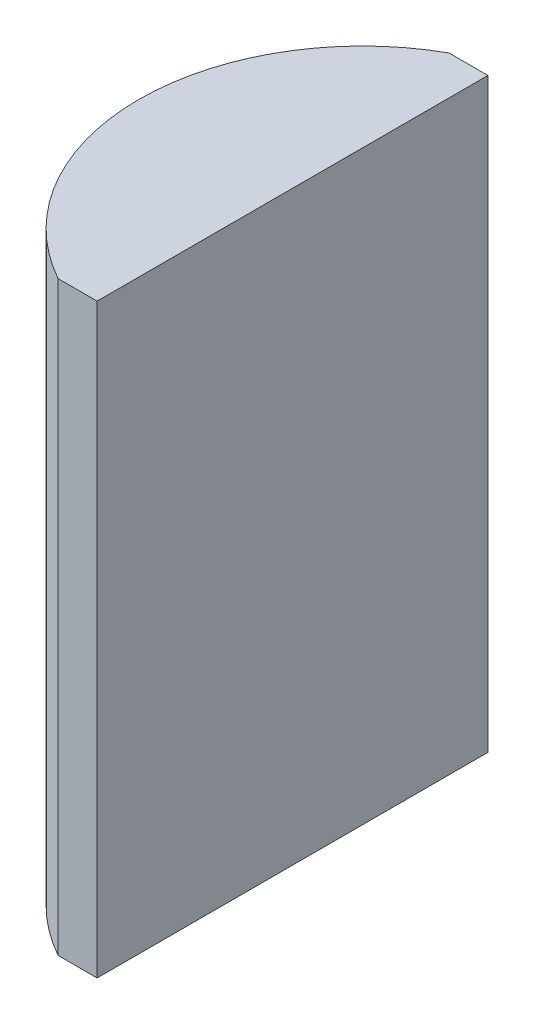
ISO-10303-21;
HEADER;
FILE_DESCRIPTION(('STEP AP214'),'2;1');
FILE_NAME('part.step','',(''),(''),'','','');
FILE_SCHEMA(('AUTOMOTIVE_DESIGN { 1 0 10303 214 1 1 1 1 }'));
ENDSEC;
DATA;
#1=APPLICATION_CONTEXT('core data for automotive mechanical design processes');
#2=APPLICATION_PROTOCOL_DEFINITION('international standard','automotive_design',2000,#1);
#3=PRODUCT_CONTEXT('',#1,'mechanical');
#4=PRODUCT('Part','Part','',(#3));
#5=PRODUCT_RELATED_PRODUCT_CATEGORY('part','',(#4));
#6=PRODUCT_DEFINITION_FORMATION('','',#4);
#7=PRODUCT_DEFINITION_CONTEXT('part definition',#1,'design');
#8=PRODUCT_DEFINITION('design','',#6,#7);
#9=PRODUCT_DEFINITION_SHAPE('','',#8);
#10=(LENGTH_UNIT() NAMED_UNIT(*) SI_UNIT(.MILLI.,.METRE.));
#11=(NAMED_UNIT(*) PLANE_ANGLE_UNIT() SI_UNIT($,.RADIAN.));
#12=(NAMED_UNIT(*) SI_UNIT($,.STERADIAN.) SOLID_ANGLE_UNIT());
#13=UNCERTAINTY_MEASURE_WITH_UNIT(LENGTH_MEASURE(1.E-05),#10,'distance_accuracy_value','');
#14=(GEOMETRIC_REPRESENTATION_CONTEXT(3) GLOBAL_UNCERTAINTY_ASSIGNED_CONTEXT((#13)) GLOBAL_UNIT_ASSIGNED_CONTEXT((#10,
#11,#12)) REPRESENTATION_CONTEXT('',''));
#15=CARTESIAN_POINT('',(0.,0.,0.));
#16=DIRECTION('',(0.,0.,1.));
#17=DIRECTION('',(1.,0.,0.));
#18=AXIS2_PLACEMENT_3D('',#15,#16,#17);
#19=CARTESIAN_POINT('',(4.35520433485127,30.,0.));
#20=DIRECTION('',(0.,-1.,0.));
#21=DIRECTION('',(0.,0.,-1.));
#22=AXIS2_PLACEMENT_3D('',#19,#20,#21);
#23=CYLINDRICAL_SURFACE('',#22,11.45);
#24=CARTESIAN_POINT('',(4.35520433485127,0.,0.));
#25=DIRECTION('',(0.,1.,0.));
#26=DIRECTION('',(0.,0.,1.));
#27=AXIS2_PLACEMENT_3D('',#24,#25,#26);
#28=CIRCLE('',#27,11.45);
#29=CARTESIAN_POINT('',(-1.22175720347765,0.,-10.));
#30=VERTEX_POINT('',#29);
#31=CARTESIAN_POINT('',(-1.22175720347769,0.,10.));
#32=VERTEX_POINT('',#31);
#33=EDGE_CURVE('E100',#30,#32,#28,.T.);
#34=ORIENTED_EDGE('',*,*,#33,.T.);
#35=DIRECTION('',(0.,-1.,0.));
#36=VECTOR('',#35,1.);
#37=CARTESIAN_POINT('',(-1.22175720347769,30.,10.));
#38=LINE('',#37,#36);
#39=CARTESIAN_POINT('',(-1.22175720347769,30.,10.));
#40=VERTEX_POINT('',#39);
#41=EDGE_CURVE('E11',#40,#32,#38,.T.);
#42=ORIENTED_EDGE('',*,*,#41,.F.);
#43=CARTESIAN_POINT('',(4.35520433485127,30.,0.));
#44=DIRECTION('',(0.,1.,0.));
#45=DIRECTION('',(0.,0.,1.));
#46=AXIS2_PLACEMENT_3D('',#43,#44,#45);
#47=CIRCLE('',#46,11.45);
#48=CARTESIAN_POINT('',(-1.22175720347765,30.,-10.));
#49=VERTEX_POINT('',#48);
#50=EDGE_CURVE('E88',#49,#40,#47,.T.);
#51=ORIENTED_EDGE('',*,*,#50,.F.);
#52=DIRECTION('',(0.,-1.,0.));
#53=VECTOR('',#52,1.);
#54=CARTESIAN_POINT('',(-1.22175720347765,30.,-10.));
#55=LINE('',#54,#53);
#56=EDGE_CURVE('E96',#49,#30,#55,.T.);
#57=ORIENTED_EDGE('',*,*,#56,.T.);
#58=EDGE_LOOP('',(#34,#42,#51,#57));
#59=FACE_BOUND('',#58,.T.);
#60=ADVANCED_FACE('F37',(#59),#23,.T.);
#61=CARTESIAN_POINT('',(-1.22175720347769,30.,10.));
#62=DIRECTION('',(0.,0.,-1.));
#63=DIRECTION('',(-1.,0.,0.));
#64=AXIS2_PLACEMENT_3D('',#61,#62,#63);
#65=PLANE('',#64);
#66=DIRECTION('',(1.,0.,0.));
#67=VECTOR('',#66,1.);
#68=CARTESIAN_POINT('',(-1.22175720347769,0.,10.));
#69=LINE('',#68,#67);
#70=CARTESIAN_POINT('',(0.775204334851265,0.,10.));
#71=VERTEX_POINT('',#70);
#72=EDGE_CURVE('E92',#32,#71,#69,.T.);
#73=ORIENTED_EDGE('',*,*,#72,.T.);
#74=DIRECTION('',(0.,-1.,0.));
#75=VECTOR('',#74,1.);
#76=CARTESIAN_POINT('',(0.775204334851265,30.,10.));
#77=LINE('',#76,#75);
#78=CARTESIAN_POINT('',(0.775204334851265,30.,10.));
#79=VERTEX_POINT('',#78);
#80=EDGE_CURVE('E45',#79,#71,#77,.T.);
#81=ORIENTED_EDGE('',*,*,#80,.F.);
#82=DIRECTION('',(1.,0.,0.));
#83=VECTOR('',#82,1.);
#84=CARTESIAN_POINT('',(-1.22175720347769,30.,10.));
#85=LINE('',#84,#83);
#86=EDGE_CURVE('E83',#40,#79,#85,.T.);
#87=ORIENTED_EDGE('',*,*,#86,.F.);
#88=ORIENTED_EDGE('',*,*,#41,.T.);
#89=EDGE_LOOP('',(#73,#81,#87,#88));
#90=FACE_BOUND('',#89,.T.);
#91=ADVANCED_FACE('F91',(#90),#65,.F.);
#92=CARTESIAN_POINT('',(0.775204334851259,30.,-10.));
#93=DIRECTION('',(-1.,0.,0.));
#94=DIRECTION('',(0.,0.,1.));
#95=AXIS2_PLACEMENT_3D('',#92,#93,#94);
#96=PLANE('',#95);
#97=DIRECTION('',(0.,0.,-1.));
#98=VECTOR('',#97,1.);
#99=CARTESIAN_POINT('',(0.775204334851259,0.,-10.));
#100=LINE('',#99,#98);
#101=CARTESIAN_POINT('',(0.775204334851259,0.,-10.));
#102=VERTEX_POINT('',#101);
#103=EDGE_CURVE('E70',#71,#102,#100,.T.);
#104=ORIENTED_EDGE('',*,*,#103,.T.);
#105=DIRECTION('',(0.,-1.,0.));
#106=VECTOR('',#105,1.);
#107=CARTESIAN_POINT('',(0.775204334851259,30.,-10.));
#108=LINE('',#107,#106);
#109=CARTESIAN_POINT('',(0.775204334851259,30.,-10.));
#110=VERTEX_POINT('',#109);
#111=EDGE_CURVE('E93',#110,#102,#108,.T.);
#112=ORIENTED_EDGE('',*,*,#111,.F.);
#113=DIRECTION('',(0.,0.,-1.));
#114=VECTOR('',#113,1.);
#115=CARTESIAN_POINT('',(0.775204334851259,30.,-10.));
#116=LINE('',#115,#114);
#117=EDGE_CURVE('E86',#79,#110,#116,.T.);
#118=ORIENTED_EDGE('',*,*,#117,.F.);
#119=ORIENTED_EDGE('',*,*,#80,.T.);
#120=EDGE_LOOP('',(#104,#112,#118,#119));
#121=FACE_BOUND('',#120,.T.);
#122=ADVANCED_FACE('F94',(#121),#96,.F.);
#123=CARTESIAN_POINT('',(-1.22175720347765,30.,-10.));
#124=DIRECTION('',(0.,0.,1.));
#125=DIRECTION('',(1.,0.,0.));
#126=AXIS2_PLACEMENT_3D('',#123,#124,#125);
#127=PLANE('',#126);
#128=DIRECTION('',(-1.,0.,0.));
#129=VECTOR('',#128,1.);
#130=CARTESIAN_POINT('',(-1.22175720347765,0.,-10.));
#131=LINE('',#130,#129);
#132=EDGE_CURVE('E76',#102,#30,#131,.T.);
#133=ORIENTED_EDGE('',*,*,#132,.T.);
#134=ORIENTED_EDGE('',*,*,#56,.F.);
#135=DIRECTION('',(-1.,0.,0.));
#136=VECTOR('',#135,1.);
#137=CARTESIAN_POINT('',(-1.22175720347765,30.,-10.));
#138=LINE('',#137,#136);
#139=EDGE_CURVE('E53',#110,#49,#138,.T.);
#140=ORIENTED_EDGE('',*,*,#139,.F.);
#141=ORIENTED_EDGE('',*,*,#111,.T.);
#142=EDGE_LOOP('',(#133,#134,#140,#141));
#143=FACE_BOUND('',#142,.T.);
#144=ADVANCED_FACE('F107',(#143),#127,.F.);
#145=CARTESIAN_POINT('',(4.35520433485127,30.,0.));
#146=DIRECTION('',(0.,1.,0.));
#147=DIRECTION('',(0.,0.,1.));
#148=AXIS2_PLACEMENT_3D('',#145,#146,#147);
#149=PLANE('',#148);
#150=ORIENTED_EDGE('',*,*,#50,.T.);
#151=ORIENTED_EDGE('',*,*,#86,.T.);
#152=ORIENTED_EDGE('',*,*,#117,.T.);
#153=ORIENTED_EDGE('',*,*,#139,.T.);
#154=EDGE_LOOP('',(#150,#151,#152,#153));
#155=FACE_BOUND('',#154,.T.);
#156=ADVANCED_FACE('F84',(#155),#149,.T.);
#157=CARTESIAN_POINT('',(4.35520433485127,0.,0.));
#158=DIRECTION('',(0.,1.,0.));
#159=DIRECTION('',(0.,0.,1.));
#160=AXIS2_PLACEMENT_3D('',#157,#158,#159);
#161=PLANE('',#160);
#162=ORIENTED_EDGE('',*,*,#33,.F.);
#163=ORIENTED_EDGE('',*,*,#132,.F.);
#164=ORIENTED_EDGE('',*,*,#103,.F.);
#165=ORIENTED_EDGE('',*,*,#72,.F.);
#166=EDGE_LOOP('',(#162,#163,#164,#165));
#167=FACE_BOUND('',#166,.T.);
#168=ADVANCED_FACE('F110',(#167),#161,.F.);
#169=CLOSED_SHELL('',(#60,#91,#122,#144,#156,#168));
#170=MANIFOLD_SOLID_BREP('B2',#169);
#171=ADVANCED_BREP_SHAPE_REPRESENTATION('',(#18,#170),#14);
#172=SHAPE_DEFINITION_REPRESENTATION(#9,#171);
ENDSEC;
END-ISO-10303-21;
